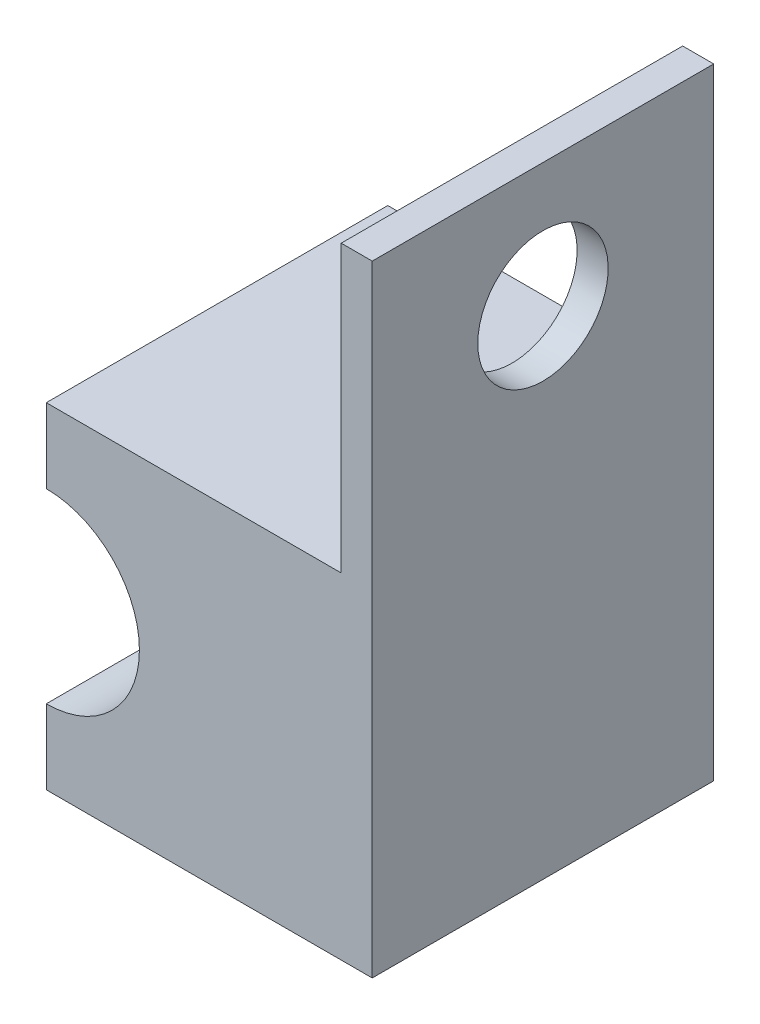
ISO-10303-21;
HEADER;
FILE_DESCRIPTION(('STEP AP214'),'2;1');
FILE_NAME('part.step','',(''),(''),'','','');
FILE_SCHEMA(('AUTOMOTIVE_DESIGN { 1 0 10303 214 1 1 1 1 }'));
ENDSEC;
DATA;
#1=APPLICATION_CONTEXT('core data for automotive mechanical design processes');
#2=APPLICATION_PROTOCOL_DEFINITION('international standard','automotive_design',2000,#1);
#3=PRODUCT_CONTEXT('',#1,'mechanical');
#4=PRODUCT('Part','Part','',(#3));
#5=PRODUCT_RELATED_PRODUCT_CATEGORY('part','',(#4));
#6=PRODUCT_DEFINITION_FORMATION('','',#4);
#7=PRODUCT_DEFINITION_CONTEXT('part definition',#1,'design');
#8=PRODUCT_DEFINITION('design','',#6,#7);
#9=PRODUCT_DEFINITION_SHAPE('','',#8);
#10=(LENGTH_UNIT() NAMED_UNIT(*) SI_UNIT(.MILLI.,.METRE.));
#11=(NAMED_UNIT(*) PLANE_ANGLE_UNIT() SI_UNIT($,.RADIAN.));
#12=(NAMED_UNIT(*) SI_UNIT($,.STERADIAN.) SOLID_ANGLE_UNIT());
#13=UNCERTAINTY_MEASURE_WITH_UNIT(LENGTH_MEASURE(1.E-05),#10,'distance_accuracy_value','');
#14=(GEOMETRIC_REPRESENTATION_CONTEXT(3) GLOBAL_UNCERTAINTY_ASSIGNED_CONTEXT((#13)) GLOBAL_UNIT_ASSIGNED_CONTEXT((#10,
#11,#12)) REPRESENTATION_CONTEXT('',''));
#15=CARTESIAN_POINT('',(0.,0.,0.));
#16=DIRECTION('',(0.,0.,1.));
#17=DIRECTION('',(1.,0.,0.));
#18=AXIS2_PLACEMENT_3D('',#15,#16,#17);
#19=CARTESIAN_POINT('',(0.,10.8,11.));
#20=DIRECTION('',(0.,-1.,0.));
#21=DIRECTION('',(0.,0.,-1.));
#22=AXIS2_PLACEMENT_3D('',#19,#20,#21);
#23=PLANE('',#22);
#24=DIRECTION('',(0.,0.,1.));
#25=VECTOR('',#24,1.);
#26=CARTESIAN_POINT('',(9.5,10.8,0.));
#27=LINE('',#26,#25);
#28=CARTESIAN_POINT('',(9.5,10.8,0.));
#29=VERTEX_POINT('',#28);
#30=CARTESIAN_POINT('',(9.5,10.8,11.));
#31=VERTEX_POINT('',#30);
#32=EDGE_CURVE('E51',#29,#31,#27,.T.);
#33=ORIENTED_EDGE('',*,*,#32,.F.);
#34=DIRECTION('',(-1.,0.,0.));
#35=VECTOR('',#34,1.);
#36=CARTESIAN_POINT('',(0.,10.8,0.));
#37=LINE('',#36,#35);
#38=CARTESIAN_POINT('',(0.,10.8,0.));
#39=VERTEX_POINT('',#38);
#40=EDGE_CURVE('E133',#29,#39,#37,.T.);
#41=ORIENTED_EDGE('',*,*,#40,.T.);
#42=DIRECTION('',(0.,0.,-1.));
#43=VECTOR('',#42,1.);
#44=CARTESIAN_POINT('',(0.,10.8,11.));
#45=LINE('',#44,#43);
#46=CARTESIAN_POINT('',(0.,10.8,11.));
#47=VERTEX_POINT('',#46);
#48=EDGE_CURVE('E44',#47,#39,#45,.T.);
#49=ORIENTED_EDGE('',*,*,#48,.F.);
#50=DIRECTION('',(-1.,0.,0.));
#51=VECTOR('',#50,1.);
#52=CARTESIAN_POINT('',(0.,10.8,11.));
#53=LINE('',#52,#51);
#54=EDGE_CURVE('E106',#31,#47,#53,.T.);
#55=ORIENTED_EDGE('',*,*,#54,.F.);
#56=EDGE_LOOP('',(#33,#41,#49,#55));
#57=FACE_BOUND('',#56,.T.);
#58=ADVANCED_FACE('F36',(#57),#23,.F.);
#59=CARTESIAN_POINT('',(10.5,0.,11.));
#60=DIRECTION('',(0.,1.,0.));
#61=DIRECTION('',(-1.,0.,0.));
#62=AXIS2_PLACEMENT_3D('',#59,#60,#61);
#63=PLANE('',#62);
#64=DIRECTION('',(1.,0.,0.));
#65=VECTOR('',#64,1.);
#66=CARTESIAN_POINT('',(10.5,0.,0.));
#67=LINE('',#66,#65);
#68=CARTESIAN_POINT('',(0.,0.,0.));
#69=VERTEX_POINT('',#68);
#70=CARTESIAN_POINT('',(10.5,0.,0.));
#71=VERTEX_POINT('',#70);
#72=EDGE_CURVE('E126',#69,#71,#67,.T.);
#73=ORIENTED_EDGE('',*,*,#72,.T.);
#74=DIRECTION('',(0.,0.,-1.));
#75=VECTOR('',#74,1.);
#76=CARTESIAN_POINT('',(10.5,0.,11.));
#77=LINE('',#76,#75);
#78=CARTESIAN_POINT('',(10.5,0.,11.));
#79=VERTEX_POINT('',#78);
#80=EDGE_CURVE('E11',#79,#71,#77,.T.);
#81=ORIENTED_EDGE('',*,*,#80,.F.);
#82=DIRECTION('',(1.,0.,0.));
#83=VECTOR('',#82,1.);
#84=CARTESIAN_POINT('',(10.5,0.,11.));
#85=LINE('',#84,#83);
#86=CARTESIAN_POINT('',(0.,0.,11.));
#87=VERTEX_POINT('',#86);
#88=EDGE_CURVE('E139',#87,#79,#85,.T.);
#89=ORIENTED_EDGE('',*,*,#88,.F.);
#90=DIRECTION('',(0.,0.,-1.));
#91=VECTOR('',#90,1.);
#92=CARTESIAN_POINT('',(0.,0.,11.));
#93=LINE('',#92,#91);
#94=EDGE_CURVE('E122',#87,#69,#93,.T.);
#95=ORIENTED_EDGE('',*,*,#94,.T.);
#96=EDGE_LOOP('',(#73,#81,#89,#95));
#97=FACE_BOUND('',#96,.T.);
#98=ADVANCED_FACE('F38',(#97),#63,.F.);
#99=CARTESIAN_POINT('',(10.5,10.8,11.));
#100=DIRECTION('',(-1.,0.,0.));
#101=DIRECTION('',(0.,-1.,0.));
#102=AXIS2_PLACEMENT_3D('',#99,#100,#101);
#103=PLANE('',#102);
#104=CARTESIAN_POINT('',(10.5,16.,5.5));
#105=DIRECTION('',(-1.,0.,0.));
#106=DIRECTION('',(0.,-1.,0.));
#107=AXIS2_PLACEMENT_3D('',#104,#105,#106);
#108=CIRCLE('',#107,2.1);
#109=CARTESIAN_POINT('',(10.5,13.9,5.5));
#110=VERTEX_POINT('',#109);
#111=EDGE_CURVE('E159',#110,#110,#108,.T.);
#112=ORIENTED_EDGE('',*,*,#111,.T.);
#113=EDGE_LOOP('',(#112));
#114=FACE_BOUND('',#113,.T.);
#115=DIRECTION('',(0.,1.,0.));
#116=VECTOR('',#115,1.);
#117=CARTESIAN_POINT('',(10.5,10.8,0.));
#118=LINE('',#117,#116);
#119=CARTESIAN_POINT('',(10.5,20.,0.));
#120=VERTEX_POINT('',#119);
#121=EDGE_CURVE('E129',#71,#120,#118,.T.);
#122=ORIENTED_EDGE('',*,*,#121,.T.);
#123=DIRECTION('',(0.,0.,-1.));
#124=VECTOR('',#123,1.);
#125=CARTESIAN_POINT('',(10.5,20.,11.));
#126=LINE('',#125,#124);
#127=CARTESIAN_POINT('',(10.5,20.,11.));
#128=VERTEX_POINT('',#127);
#129=EDGE_CURVE('E158',#128,#120,#126,.T.);
#130=ORIENTED_EDGE('',*,*,#129,.F.);
#131=DIRECTION('',(0.,1.,0.));
#132=VECTOR('',#131,1.);
#133=CARTESIAN_POINT('',(10.5,10.8,11.));
#134=LINE('',#133,#132);
#135=EDGE_CURVE('E91',#79,#128,#134,.T.);
#136=ORIENTED_EDGE('',*,*,#135,.F.);
#137=ORIENTED_EDGE('',*,*,#80,.T.);
#138=EDGE_LOOP('',(#122,#130,#136,#137));
#139=FACE_BOUND('',#138,.T.);
#140=ADVANCED_FACE('F192',(#114,#139),#103,.F.);
#141=CARTESIAN_POINT('',(0.,8.4,11.));
#142=DIRECTION('',(1.,0.,0.));
#143=DIRECTION('',(0.,0.,-1.));
#144=AXIS2_PLACEMENT_3D('',#141,#142,#143);
#145=PLANE('',#144);
#146=DIRECTION('',(0.,-1.,0.));
#147=VECTOR('',#146,1.);
#148=CARTESIAN_POINT('',(0.,8.4,0.));
#149=LINE('',#148,#147);
#150=CARTESIAN_POINT('',(0.,8.4,0.));
#151=VERTEX_POINT('',#150);
#152=EDGE_CURVE('E115',#39,#151,#149,.T.);
#153=ORIENTED_EDGE('',*,*,#152,.T.);
#154=DIRECTION('',(0.,0.,-1.));
#155=VECTOR('',#154,1.);
#156=CARTESIAN_POINT('',(0.,8.4,11.));
#157=LINE('',#156,#155);
#158=CARTESIAN_POINT('',(0.,8.4,11.));
#159=VERTEX_POINT('',#158);
#160=EDGE_CURVE('E112',#159,#151,#157,.T.);
#161=ORIENTED_EDGE('',*,*,#160,.F.);
#162=DIRECTION('',(0.,-1.,0.));
#163=VECTOR('',#162,1.);
#164=CARTESIAN_POINT('',(0.,8.4,11.));
#165=LINE('',#164,#163);
#166=EDGE_CURVE('E99',#47,#159,#165,.T.);
#167=ORIENTED_EDGE('',*,*,#166,.F.);
#168=ORIENTED_EDGE('',*,*,#48,.T.);
#169=EDGE_LOOP('',(#153,#161,#167,#168));
#170=FACE_BOUND('',#169,.T.);
#171=ADVANCED_FACE('F113',(#170),#145,.F.);
#172=CARTESIAN_POINT('',(0.,5.4,11.));
#173=DIRECTION('',(0.,0.,-1.));
#174=DIRECTION('',(-1.,0.,0.));
#175=AXIS2_PLACEMENT_3D('',#172,#173,#174);
#176=CYLINDRICAL_SURFACE('',#175,3.);
#177=CARTESIAN_POINT('',(0.,5.4,0.));
#178=DIRECTION('',(0.,0.,-1.));
#179=DIRECTION('',(1.,0.,0.));
#180=AXIS2_PLACEMENT_3D('',#177,#178,#179);
#181=CIRCLE('',#180,3.);
#182=CARTESIAN_POINT('',(0.,2.4,0.));
#183=VERTEX_POINT('',#182);
#184=EDGE_CURVE('E136',#151,#183,#181,.T.);
#185=ORIENTED_EDGE('',*,*,#184,.T.);
#186=DIRECTION('',(0.,0.,-1.));
#187=VECTOR('',#186,1.);
#188=CARTESIAN_POINT('',(0.,2.4,11.));
#189=LINE('',#188,#187);
#190=CARTESIAN_POINT('',(0.,2.4,11.));
#191=VERTEX_POINT('',#190);
#192=EDGE_CURVE('E118',#191,#183,#189,.T.);
#193=ORIENTED_EDGE('',*,*,#192,.F.);
#194=CARTESIAN_POINT('',(0.,5.4,11.));
#195=DIRECTION('',(0.,0.,-1.));
#196=DIRECTION('',(1.,0.,0.));
#197=AXIS2_PLACEMENT_3D('',#194,#195,#196);
#198=CIRCLE('',#197,3.);
#199=EDGE_CURVE('E103',#159,#191,#198,.T.);
#200=ORIENTED_EDGE('',*,*,#199,.F.);
#201=ORIENTED_EDGE('',*,*,#160,.T.);
#202=EDGE_LOOP('',(#185,#193,#200,#201));
#203=FACE_BOUND('',#202,.T.);
#204=ADVANCED_FACE('F120',(#203),#176,.F.);
#205=CARTESIAN_POINT('',(0.,0.,11.));
#206=DIRECTION('',(1.,0.,0.));
#207=DIRECTION('',(0.,0.,-1.));
#208=AXIS2_PLACEMENT_3D('',#205,#206,#207);
#209=PLANE('',#208);
#210=DIRECTION('',(0.,-1.,0.));
#211=VECTOR('',#210,1.);
#212=CARTESIAN_POINT('',(0.,0.,0.));
#213=LINE('',#212,#211);
#214=EDGE_CURVE('E83',#183,#69,#213,.T.);
#215=ORIENTED_EDGE('',*,*,#214,.T.);
#216=ORIENTED_EDGE('',*,*,#94,.F.);
#217=DIRECTION('',(0.,-1.,0.));
#218=VECTOR('',#217,1.);
#219=CARTESIAN_POINT('',(0.,0.,11.));
#220=LINE('',#219,#218);
#221=EDGE_CURVE('E60',#191,#87,#220,.T.);
#222=ORIENTED_EDGE('',*,*,#221,.F.);
#223=ORIENTED_EDGE('',*,*,#192,.T.);
#224=EDGE_LOOP('',(#215,#216,#222,#223));
#225=FACE_BOUND('',#224,.T.);
#226=ADVANCED_FACE('F146',(#225),#209,.F.);
#227=CARTESIAN_POINT('',(0.,5.4,11.));
#228=DIRECTION('',(0.,0.,1.));
#229=DIRECTION('',(1.,0.,0.));
#230=AXIS2_PLACEMENT_3D('',#227,#228,#229);
#231=PLANE('',#230);
#232=ORIENTED_EDGE('',*,*,#88,.T.);
#233=ORIENTED_EDGE('',*,*,#135,.T.);
#234=DIRECTION('',(1.,0.,0.));
#235=VECTOR('',#234,1.);
#236=CARTESIAN_POINT('',(9.5,20.,11.));
#237=LINE('',#236,#235);
#238=CARTESIAN_POINT('',(9.5,20.,11.));
#239=VERTEX_POINT('',#238);
#240=EDGE_CURVE('E156',#239,#128,#237,.T.);
#241=ORIENTED_EDGE('',*,*,#240,.F.);
#242=DIRECTION('',(0.,-1.,0.));
#243=VECTOR('',#242,1.);
#244=CARTESIAN_POINT('',(9.5,20.,11.));
#245=LINE('',#244,#243);
#246=EDGE_CURVE('E154',#239,#31,#245,.T.);
#247=ORIENTED_EDGE('',*,*,#246,.T.);
#248=ORIENTED_EDGE('',*,*,#54,.T.);
#249=ORIENTED_EDGE('',*,*,#166,.T.);
#250=ORIENTED_EDGE('',*,*,#199,.T.);
#251=ORIENTED_EDGE('',*,*,#221,.T.);
#252=EDGE_LOOP('',(#232,#233,#241,#247,#248,#249,#250,#251));
#253=FACE_BOUND('',#252,.T.);
#254=ADVANCED_FACE('F101',(#253),#231,.T.);
#255=CARTESIAN_POINT('',(0.,5.4,0.));
#256=DIRECTION('',(0.,0.,1.));
#257=DIRECTION('',(1.,0.,0.));
#258=AXIS2_PLACEMENT_3D('',#255,#256,#257);
#259=PLANE('',#258);
#260=ORIENTED_EDGE('',*,*,#72,.F.);
#261=ORIENTED_EDGE('',*,*,#214,.F.);
#262=ORIENTED_EDGE('',*,*,#184,.F.);
#263=ORIENTED_EDGE('',*,*,#152,.F.);
#264=ORIENTED_EDGE('',*,*,#40,.F.);
#265=DIRECTION('',(0.,-1.,0.));
#266=VECTOR('',#265,1.);
#267=CARTESIAN_POINT('',(9.5,20.,0.));
#268=LINE('',#267,#266);
#269=CARTESIAN_POINT('',(9.5,20.,0.));
#270=VERTEX_POINT('',#269);
#271=EDGE_CURVE('E130',#270,#29,#268,.T.);
#272=ORIENTED_EDGE('',*,*,#271,.F.);
#273=DIRECTION('',(-1.,0.,0.));
#274=VECTOR('',#273,1.);
#275=CARTESIAN_POINT('',(10.5,20.,0.));
#276=LINE('',#275,#274);
#277=EDGE_CURVE('E165',#120,#270,#276,.T.);
#278=ORIENTED_EDGE('',*,*,#277,.F.);
#279=ORIENTED_EDGE('',*,*,#121,.F.);
#280=EDGE_LOOP('',(#260,#261,#262,#263,#264,#272,#278,#279));
#281=FACE_BOUND('',#280,.T.);
#282=ADVANCED_FACE('F143',(#281),#259,.F.);
#283=CARTESIAN_POINT('',(9.5,20.,0.));
#284=DIRECTION('',(1.,0.,0.));
#285=DIRECTION('',(0.,0.,-1.));
#286=AXIS2_PLACEMENT_3D('',#283,#284,#285);
#287=PLANE('',#286);
#288=CARTESIAN_POINT('',(9.5,16.,5.5));
#289=DIRECTION('',(-1.,0.,0.));
#290=DIRECTION('',(0.,0.,1.));
#291=AXIS2_PLACEMENT_3D('',#288,#289,#290);
#292=CIRCLE('',#291,2.1);
#293=CARTESIAN_POINT('',(9.5,16.,7.6));
#294=VERTEX_POINT('',#293);
#295=EDGE_CURVE('E172',#294,#294,#292,.T.);
#296=ORIENTED_EDGE('',*,*,#295,.F.);
#297=EDGE_LOOP('',(#296));
#298=FACE_BOUND('',#297,.T.);
#299=ORIENTED_EDGE('',*,*,#32,.T.);
#300=ORIENTED_EDGE('',*,*,#246,.F.);
#301=DIRECTION('',(0.,0.,1.));
#302=VECTOR('',#301,1.);
#303=CARTESIAN_POINT('',(9.5,20.,0.));
#304=LINE('',#303,#302);
#305=EDGE_CURVE('E162',#270,#239,#304,.T.);
#306=ORIENTED_EDGE('',*,*,#305,.F.);
#307=ORIENTED_EDGE('',*,*,#271,.T.);
#308=EDGE_LOOP('',(#299,#300,#306,#307));
#309=FACE_BOUND('',#308,.T.);
#310=ADVANCED_FACE('F179',(#298,#309),#287,.F.);
#311=CARTESIAN_POINT('',(0.,20.,0.));
#312=DIRECTION('',(0.,1.,0.));
#313=DIRECTION('',(0.,0.,1.));
#314=AXIS2_PLACEMENT_3D('',#311,#312,#313);
#315=PLANE('',#314);
#316=ORIENTED_EDGE('',*,*,#129,.T.);
#317=ORIENTED_EDGE('',*,*,#277,.T.);
#318=ORIENTED_EDGE('',*,*,#305,.T.);
#319=ORIENTED_EDGE('',*,*,#240,.T.);
#320=EDGE_LOOP('',(#316,#317,#318,#319));
#321=FACE_BOUND('',#320,.T.);
#322=ADVANCED_FACE('F182',(#321),#315,.T.);
#323=CARTESIAN_POINT('',(19.5,16.,5.5));
#324=DIRECTION('',(-1.,0.,0.));
#325=DIRECTION('',(0.,0.,1.));
#326=AXIS2_PLACEMENT_3D('',#323,#324,#325);
#327=CYLINDRICAL_SURFACE('',#326,2.1);
#328=ORIENTED_EDGE('',*,*,#295,.T.);
#329=EDGE_LOOP('',(#328));
#330=FACE_BOUND('',#329,.T.);
#331=ORIENTED_EDGE('',*,*,#111,.F.);
#332=EDGE_LOOP('',(#331));
#333=FACE_BOUND('',#332,.T.);
#334=ADVANCED_FACE('F176',(#330,#333),#327,.F.);
#335=CLOSED_SHELL('',(#58,#98,#140,#171,#204,#226,#254,#282,#310,#322,#334));
#336=MANIFOLD_SOLID_BREP('B2',#335);
#337=ADVANCED_BREP_SHAPE_REPRESENTATION('',(#18,#336),#14);
#338=SHAPE_DEFINITION_REPRESENTATION(#9,#337);
ENDSEC;
END-ISO-10303-21;
